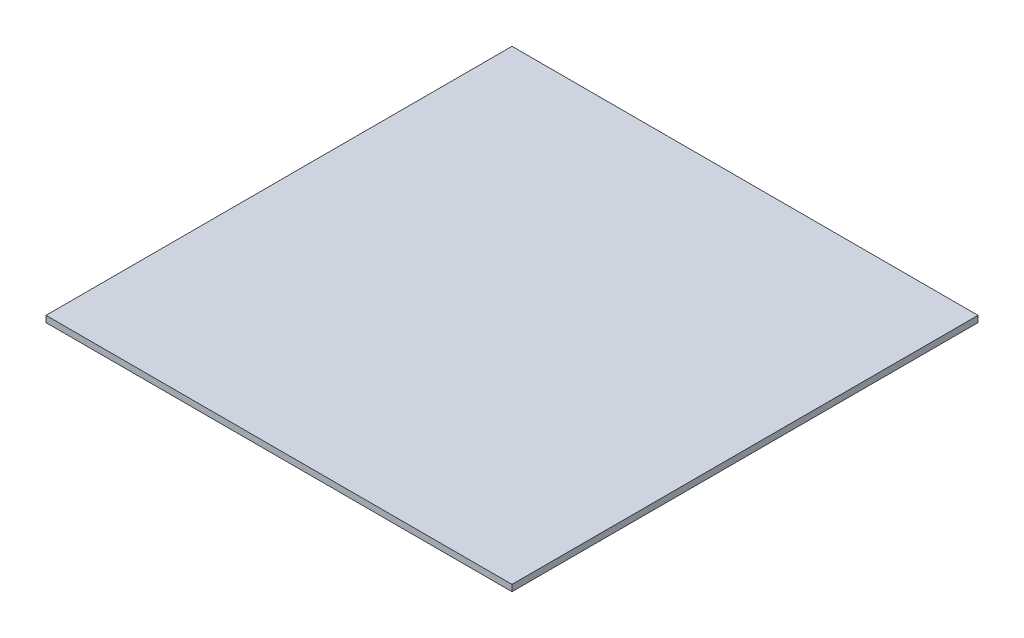
ISO-10303-21;
HEADER;
FILE_DESCRIPTION(('STEP AP214'),'2;1');
FILE_NAME('part.step','',(''),(''),'','','');
FILE_SCHEMA(('AUTOMOTIVE_DESIGN { 1 0 10303 214 1 1 1 1 }'));
ENDSEC;
DATA;
#1=APPLICATION_CONTEXT('core data for automotive mechanical design processes');
#2=APPLICATION_PROTOCOL_DEFINITION('international standard','automotive_design',2000,#1);
#3=PRODUCT_CONTEXT('',#1,'mechanical');
#4=PRODUCT('Part','Part','',(#3));
#5=PRODUCT_RELATED_PRODUCT_CATEGORY('part','',(#4));
#6=PRODUCT_DEFINITION_FORMATION('','',#4);
#7=PRODUCT_DEFINITION_CONTEXT('part definition',#1,'design');
#8=PRODUCT_DEFINITION('design','',#6,#7);
#9=PRODUCT_DEFINITION_SHAPE('','',#8);
#10=(LENGTH_UNIT() NAMED_UNIT(*) SI_UNIT(.MILLI.,.METRE.));
#11=(NAMED_UNIT(*) PLANE_ANGLE_UNIT() SI_UNIT($,.RADIAN.));
#12=(NAMED_UNIT(*) SI_UNIT($,.STERADIAN.) SOLID_ANGLE_UNIT());
#13=UNCERTAINTY_MEASURE_WITH_UNIT(LENGTH_MEASURE(1.E-05),#10,'distance_accuracy_value','');
#14=(GEOMETRIC_REPRESENTATION_CONTEXT(3) GLOBAL_UNCERTAINTY_ASSIGNED_CONTEXT((#13)) GLOBAL_UNIT_ASSIGNED_CONTEXT((#10,
#11,#12)) REPRESENTATION_CONTEXT('',''));
#15=CARTESIAN_POINT('',(0.,0.,0.));
#16=DIRECTION('',(0.,0.,1.));
#17=DIRECTION('',(1.,0.,0.));
#18=AXIS2_PLACEMENT_3D('',#15,#16,#17);
#19=CARTESIAN_POINT('',(-121.244370766708,3.,-138.74155199175));
#20=DIRECTION('',(1.,0.,0.));
#21=DIRECTION('',(0.,0.,-1.));
#22=AXIS2_PLACEMENT_3D('',#19,#20,#21);
#23=PLANE('',#22);
#24=DIRECTION('',(0.,0.,1.));
#25=VECTOR('',#24,1.);
#26=CARTESIAN_POINT('',(-121.244370766708,0.,-138.74155199175));
#27=LINE('',#26,#25);
#28=CARTESIAN_POINT('',(-121.244370766708,0.,-138.74155199175));
#29=VERTEX_POINT('',#28);
#30=CARTESIAN_POINT('',(-121.244370766707,0.,81.2584480082502));
#31=VERTEX_POINT('',#30);
#32=EDGE_CURVE('E96',#29,#31,#27,.T.);
#33=ORIENTED_EDGE('',*,*,#32,.T.);
#34=DIRECTION('',(0.,-1.,0.));
#35=VECTOR('',#34,1.);
#36=CARTESIAN_POINT('',(-121.244370766707,3.,81.2584480082502));
#37=LINE('',#36,#35);
#38=CARTESIAN_POINT('',(-121.244370766707,3.,81.2584480082502));
#39=VERTEX_POINT('',#38);
#40=EDGE_CURVE('E11',#39,#31,#37,.T.);
#41=ORIENTED_EDGE('',*,*,#40,.F.);
#42=DIRECTION('',(0.,0.,1.));
#43=VECTOR('',#42,1.);
#44=CARTESIAN_POINT('',(-121.244370766708,3.,-138.74155199175));
#45=LINE('',#44,#43);
#46=CARTESIAN_POINT('',(-121.244370766708,3.,-138.74155199175));
#47=VERTEX_POINT('',#46);
#48=EDGE_CURVE('E84',#47,#39,#45,.T.);
#49=ORIENTED_EDGE('',*,*,#48,.F.);
#50=DIRECTION('',(0.,-1.,0.));
#51=VECTOR('',#50,1.);
#52=CARTESIAN_POINT('',(-121.244370766708,3.,-138.74155199175));
#53=LINE('',#52,#51);
#54=EDGE_CURVE('E92',#47,#29,#53,.T.);
#55=ORIENTED_EDGE('',*,*,#54,.T.);
#56=EDGE_LOOP('',(#33,#41,#49,#55));
#57=FACE_BOUND('',#56,.T.);
#58=ADVANCED_FACE('F33',(#57),#23,.F.);
#59=CARTESIAN_POINT('',(-121.244370766707,3.,81.2584480082502));
#60=DIRECTION('',(0.,0.,-1.));
#61=DIRECTION('',(-1.,0.,0.));
#62=AXIS2_PLACEMENT_3D('',#59,#60,#61);
#63=PLANE('',#62);
#64=DIRECTION('',(1.,0.,0.));
#65=VECTOR('',#64,1.);
#66=CARTESIAN_POINT('',(-121.244370766707,0.,81.2584480082502));
#67=LINE('',#66,#65);
#68=CARTESIAN_POINT('',(98.7556292332925,0.,81.2584480082502));
#69=VERTEX_POINT('',#68);
#70=EDGE_CURVE('E88',#31,#69,#67,.T.);
#71=ORIENTED_EDGE('',*,*,#70,.T.);
#72=DIRECTION('',(0.,-1.,0.));
#73=VECTOR('',#72,1.);
#74=CARTESIAN_POINT('',(98.7556292332925,3.,81.2584480082502));
#75=LINE('',#74,#73);
#76=CARTESIAN_POINT('',(98.7556292332925,3.,81.2584480082502));
#77=VERTEX_POINT('',#76);
#78=EDGE_CURVE('E41',#77,#69,#75,.T.);
#79=ORIENTED_EDGE('',*,*,#78,.F.);
#80=DIRECTION('',(1.,0.,0.));
#81=VECTOR('',#80,1.);
#82=CARTESIAN_POINT('',(-121.244370766707,3.,81.2584480082502));
#83=LINE('',#82,#81);
#84=EDGE_CURVE('E79',#39,#77,#83,.T.);
#85=ORIENTED_EDGE('',*,*,#84,.F.);
#86=ORIENTED_EDGE('',*,*,#40,.T.);
#87=EDGE_LOOP('',(#71,#79,#85,#86));
#88=FACE_BOUND('',#87,.T.);
#89=ADVANCED_FACE('F87',(#88),#63,.F.);
#90=CARTESIAN_POINT('',(98.7556292332925,3.,-138.74155199175));
#91=DIRECTION('',(-1.,0.,0.));
#92=DIRECTION('',(0.,0.,1.));
#93=AXIS2_PLACEMENT_3D('',#90,#91,#92);
#94=PLANE('',#93);
#95=DIRECTION('',(0.,0.,-1.));
#96=VECTOR('',#95,1.);
#97=CARTESIAN_POINT('',(98.7556292332925,0.,-138.74155199175));
#98=LINE('',#97,#96);
#99=CARTESIAN_POINT('',(98.7556292332925,0.,-138.74155199175));
#100=VERTEX_POINT('',#99);
#101=EDGE_CURVE('E66',#69,#100,#98,.T.);
#102=ORIENTED_EDGE('',*,*,#101,.T.);
#103=DIRECTION('',(0.,-1.,0.));
#104=VECTOR('',#103,1.);
#105=CARTESIAN_POINT('',(98.7556292332925,3.,-138.74155199175));
#106=LINE('',#105,#104);
#107=CARTESIAN_POINT('',(98.7556292332925,3.,-138.74155199175));
#108=VERTEX_POINT('',#107);
#109=EDGE_CURVE('E89',#108,#100,#106,.T.);
#110=ORIENTED_EDGE('',*,*,#109,.F.);
#111=DIRECTION('',(0.,0.,-1.));
#112=VECTOR('',#111,1.);
#113=CARTESIAN_POINT('',(98.7556292332925,3.,-138.74155199175));
#114=LINE('',#113,#112);
#115=EDGE_CURVE('E82',#77,#108,#114,.T.);
#116=ORIENTED_EDGE('',*,*,#115,.F.);
#117=ORIENTED_EDGE('',*,*,#78,.T.);
#118=EDGE_LOOP('',(#102,#110,#116,#117));
#119=FACE_BOUND('',#118,.T.);
#120=ADVANCED_FACE('F90',(#119),#94,.F.);
#121=CARTESIAN_POINT('',(-121.244370766708,3.,-138.74155199175));
#122=DIRECTION('',(0.,0.,1.));
#123=DIRECTION('',(1.,0.,0.));
#124=AXIS2_PLACEMENT_3D('',#121,#122,#123);
#125=PLANE('',#124);
#126=DIRECTION('',(-1.,0.,0.));
#127=VECTOR('',#126,1.);
#128=CARTESIAN_POINT('',(-121.244370766708,0.,-138.74155199175));
#129=LINE('',#128,#127);
#130=EDGE_CURVE('E72',#100,#29,#129,.T.);
#131=ORIENTED_EDGE('',*,*,#130,.T.);
#132=ORIENTED_EDGE('',*,*,#54,.F.);
#133=DIRECTION('',(-1.,0.,0.));
#134=VECTOR('',#133,1.);
#135=CARTESIAN_POINT('',(-121.244370766708,3.,-138.74155199175));
#136=LINE('',#135,#134);
#137=EDGE_CURVE('E49',#108,#47,#136,.T.);
#138=ORIENTED_EDGE('',*,*,#137,.F.);
#139=ORIENTED_EDGE('',*,*,#109,.T.);
#140=EDGE_LOOP('',(#131,#132,#138,#139));
#141=FACE_BOUND('',#140,.T.);
#142=ADVANCED_FACE('F103',(#141),#125,.F.);
#143=CARTESIAN_POINT('',(0.,3.,0.));
#144=DIRECTION('',(0.,1.,0.));
#145=DIRECTION('',(0.,0.,1.));
#146=AXIS2_PLACEMENT_3D('',#143,#144,#145);
#147=PLANE('',#146);
#148=ORIENTED_EDGE('',*,*,#48,.T.);
#149=ORIENTED_EDGE('',*,*,#84,.T.);
#150=ORIENTED_EDGE('',*,*,#115,.T.);
#151=ORIENTED_EDGE('',*,*,#137,.T.);
#152=EDGE_LOOP('',(#148,#149,#150,#151));
#153=FACE_BOUND('',#152,.T.);
#154=ADVANCED_FACE('F80',(#153),#147,.T.);
#155=CARTESIAN_POINT('',(0.,0.,0.));
#156=DIRECTION('',(0.,1.,0.));
#157=DIRECTION('',(0.,0.,1.));
#158=AXIS2_PLACEMENT_3D('',#155,#156,#157);
#159=PLANE('',#158);
#160=ORIENTED_EDGE('',*,*,#32,.F.);
#161=ORIENTED_EDGE('',*,*,#130,.F.);
#162=ORIENTED_EDGE('',*,*,#101,.F.);
#163=ORIENTED_EDGE('',*,*,#70,.F.);
#164=EDGE_LOOP('',(#160,#161,#162,#163));
#165=FACE_BOUND('',#164,.T.);
#166=ADVANCED_FACE('F106',(#165),#159,.F.);
#167=CLOSED_SHELL('',(#58,#89,#120,#142,#154,#166));
#168=MANIFOLD_SOLID_BREP('B2',#167);
#169=ADVANCED_BREP_SHAPE_REPRESENTATION('',(#18,#168),#14);
#170=SHAPE_DEFINITION_REPRESENTATION(#9,#169);
ENDSEC;
END-ISO-10303-21;
